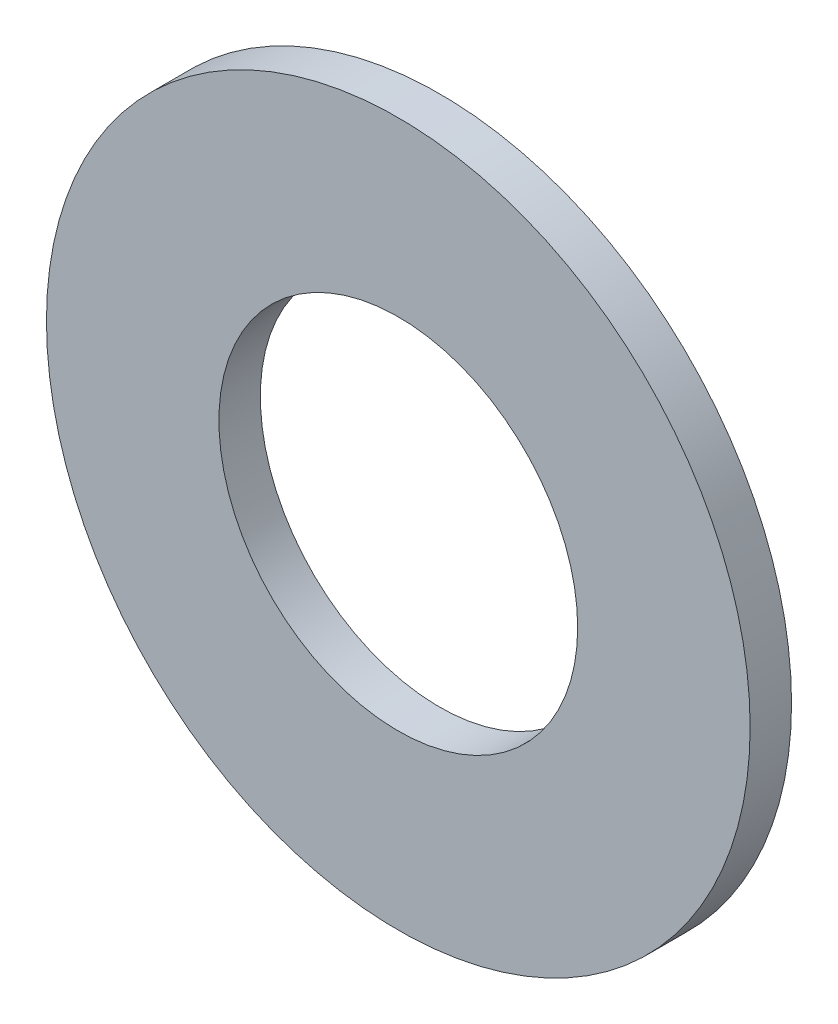
ISO-10303-21;
HEADER;
FILE_DESCRIPTION(('STEP AP214'),'2;1');
FILE_NAME('part.step','',(''),(''),'','','');
FILE_SCHEMA(('AUTOMOTIVE_DESIGN { 1 0 10303 214 1 1 1 1 }'));
ENDSEC;
DATA;
#1=APPLICATION_CONTEXT('core data for automotive mechanical design processes');
#2=APPLICATION_PROTOCOL_DEFINITION('international standard','automotive_design',2000,#1);
#3=PRODUCT_CONTEXT('',#1,'mechanical');
#4=PRODUCT('Part','Part','',(#3));
#5=PRODUCT_RELATED_PRODUCT_CATEGORY('part','',(#4));
#6=PRODUCT_DEFINITION_FORMATION('','',#4);
#7=PRODUCT_DEFINITION_CONTEXT('part definition',#1,'design');
#8=PRODUCT_DEFINITION('design','',#6,#7);
#9=PRODUCT_DEFINITION_SHAPE('','',#8);
#10=(LENGTH_UNIT() NAMED_UNIT(*) SI_UNIT(.MILLI.,.METRE.));
#11=(NAMED_UNIT(*) PLANE_ANGLE_UNIT() SI_UNIT($,.RADIAN.));
#12=(NAMED_UNIT(*) SI_UNIT($,.STERADIAN.) SOLID_ANGLE_UNIT());
#13=UNCERTAINTY_MEASURE_WITH_UNIT(LENGTH_MEASURE(1.E-05),#10,'distance_accuracy_value','');
#14=(GEOMETRIC_REPRESENTATION_CONTEXT(3) GLOBAL_UNCERTAINTY_ASSIGNED_CONTEXT((#13)) GLOBAL_UNIT_ASSIGNED_CONTEXT((#10,
#11,#12)) REPRESENTATION_CONTEXT('',''));
#15=CARTESIAN_POINT('',(0.,0.,0.));
#16=DIRECTION('',(0.,0.,1.));
#17=DIRECTION('',(1.,0.,0.));
#18=AXIS2_PLACEMENT_3D('',#15,#16,#17);
#19=CARTESIAN_POINT('',(0.,0.,0.6));
#20=DIRECTION('',(0.,0.,-1.));
#21=DIRECTION('',(-1.,0.,0.));
#22=AXIS2_PLACEMENT_3D('',#19,#20,#21);
#23=PLANE('',#22);
#24=CARTESIAN_POINT('',(0.,0.,0.6));
#25=DIRECTION('',(0.,0.,1.));
#26=DIRECTION('',(1.,0.,0.));
#27=AXIS2_PLACEMENT_3D('',#24,#25,#26);
#28=CIRCLE('',#27,2.6);
#29=CARTESIAN_POINT('',(2.6,0.,0.6));
#30=VERTEX_POINT('',#29);
#31=EDGE_CURVE('E27',#30,#30,#28,.F.);
#32=ORIENTED_EDGE('',*,*,#31,.T.);
#33=EDGE_LOOP('',(#32));
#34=FACE_BOUND('',#33,.T.);
#35=CARTESIAN_POINT('',(0.,0.,0.6));
#36=DIRECTION('',(0.,0.,1.));
#37=DIRECTION('',(1.,0.,0.));
#38=AXIS2_PLACEMENT_3D('',#35,#36,#37);
#39=CIRCLE('',#38,5.1);
#40=CARTESIAN_POINT('',(5.1,0.,0.6));
#41=VERTEX_POINT('',#40);
#42=EDGE_CURVE('E18',#41,#41,#39,.F.);
#43=ORIENTED_EDGE('',*,*,#42,.F.);
#44=EDGE_LOOP('',(#43));
#45=FACE_BOUND('',#44,.T.);
#46=ADVANCED_FACE('F15',(#34,#45),#23,.F.);
#47=CARTESIAN_POINT('',(0.,0.,0.));
#48=DIRECTION('',(0.,0.,1.));
#49=DIRECTION('',(1.,0.,0.));
#50=AXIS2_PLACEMENT_3D('',#47,#48,#49);
#51=CYLINDRICAL_SURFACE('',#50,5.1);
#52=CARTESIAN_POINT('',(0.,0.,0.));
#53=DIRECTION('',(0.,0.,1.));
#54=DIRECTION('',(1.,0.,0.));
#55=AXIS2_PLACEMENT_3D('',#52,#53,#54);
#56=CIRCLE('',#55,5.1);
#57=CARTESIAN_POINT('',(5.1,0.,0.));
#58=VERTEX_POINT('',#57);
#59=EDGE_CURVE('E22',#58,#58,#56,.F.);
#60=ORIENTED_EDGE('',*,*,#59,.F.);
#61=EDGE_LOOP('',(#60));
#62=FACE_BOUND('',#61,.T.);
#63=ORIENTED_EDGE('',*,*,#42,.T.);
#64=EDGE_LOOP('',(#63));
#65=FACE_BOUND('',#64,.T.);
#66=ADVANCED_FACE('F35',(#62,#65),#51,.T.);
#67=CARTESIAN_POINT('',(0.,0.,0.));
#68=DIRECTION('',(0.,0.,1.));
#69=DIRECTION('',(1.,0.,0.));
#70=AXIS2_PLACEMENT_3D('',#67,#68,#69);
#71=CYLINDRICAL_SURFACE('',#70,2.6);
#72=ORIENTED_EDGE('',*,*,#31,.F.);
#73=EDGE_LOOP('',(#72));
#74=FACE_BOUND('',#73,.T.);
#75=CARTESIAN_POINT('',(0.,0.,0.));
#76=DIRECTION('',(0.,0.,1.));
#77=DIRECTION('',(1.,0.,0.));
#78=AXIS2_PLACEMENT_3D('',#75,#76,#77);
#79=CIRCLE('',#78,2.6);
#80=CARTESIAN_POINT('',(2.6,0.,0.));
#81=VERTEX_POINT('',#80);
#82=EDGE_CURVE('E9',#81,#81,#79,.T.);
#83=ORIENTED_EDGE('',*,*,#82,.F.);
#84=EDGE_LOOP('',(#83));
#85=FACE_BOUND('',#84,.T.);
#86=ADVANCED_FACE('F41',(#74,#85),#71,.F.);
#87=CARTESIAN_POINT('',(0.,0.,0.));
#88=DIRECTION('',(0.,0.,-1.));
#89=DIRECTION('',(-1.,0.,0.));
#90=AXIS2_PLACEMENT_3D('',#87,#88,#89);
#91=PLANE('',#90);
#92=ORIENTED_EDGE('',*,*,#82,.T.);
#93=EDGE_LOOP('',(#92));
#94=FACE_BOUND('',#93,.T.);
#95=ORIENTED_EDGE('',*,*,#59,.T.);
#96=EDGE_LOOP('',(#95));
#97=FACE_BOUND('',#96,.T.);
#98=ADVANCED_FACE('F43',(#94,#97),#91,.T.);
#99=CLOSED_SHELL('',(#46,#66,#86,#98));
#100=MANIFOLD_SOLID_BREP('B1',#99);
#101=ADVANCED_BREP_SHAPE_REPRESENTATION('',(#18,#100),#14);
#102=SHAPE_DEFINITION_REPRESENTATION(#9,#101);
ENDSEC;
END-ISO-10303-21;
